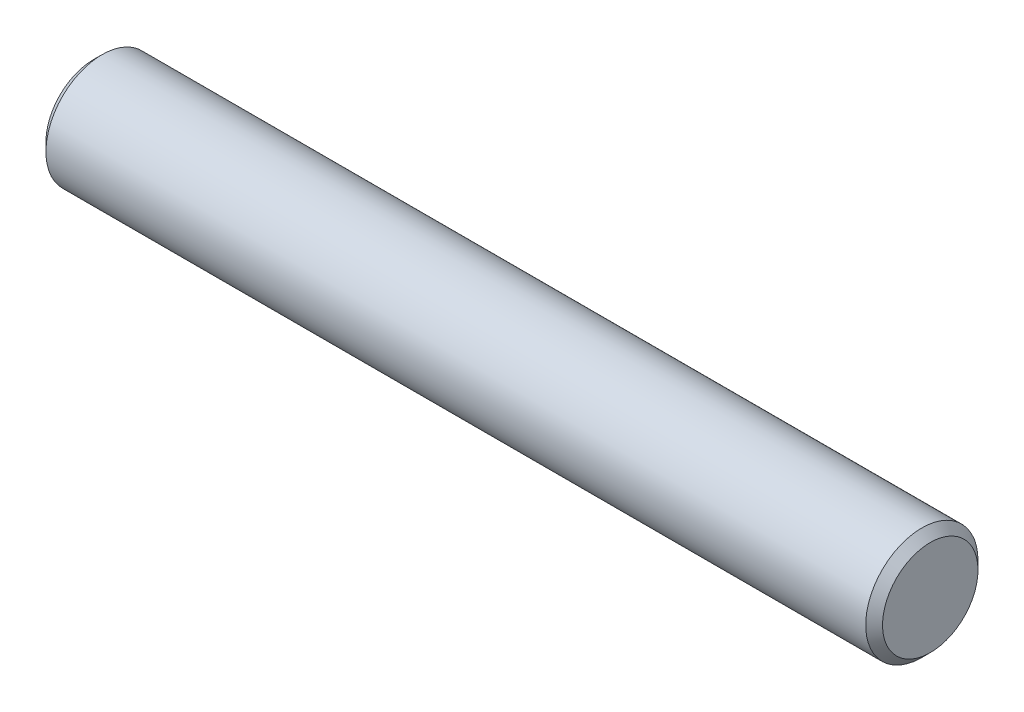
ISO-10303-21;
HEADER;
FILE_DESCRIPTION(('STEP AP214'),'2;1');
FILE_NAME('part.step','',(''),(''),'','','');
FILE_SCHEMA(('AUTOMOTIVE_DESIGN { 1 0 10303 214 1 1 1 1 }'));
ENDSEC;
DATA;
#1=APPLICATION_CONTEXT('core data for automotive mechanical design processes');
#2=APPLICATION_PROTOCOL_DEFINITION('international standard','automotive_design',2000,#1);
#3=PRODUCT_CONTEXT('',#1,'mechanical');
#4=PRODUCT('Part','Part','',(#3));
#5=PRODUCT_RELATED_PRODUCT_CATEGORY('part','',(#4));
#6=PRODUCT_DEFINITION_FORMATION('','',#4);
#7=PRODUCT_DEFINITION_CONTEXT('part definition',#1,'design');
#8=PRODUCT_DEFINITION('design','',#6,#7);
#9=PRODUCT_DEFINITION_SHAPE('','',#8);
#10=(LENGTH_UNIT() NAMED_UNIT(*) SI_UNIT(.MILLI.,.METRE.));
#11=(NAMED_UNIT(*) PLANE_ANGLE_UNIT() SI_UNIT($,.RADIAN.));
#12=(NAMED_UNIT(*) SI_UNIT($,.STERADIAN.) SOLID_ANGLE_UNIT());
#13=UNCERTAINTY_MEASURE_WITH_UNIT(LENGTH_MEASURE(1.E-05),#10,'distance_accuracy_value','');
#14=(GEOMETRIC_REPRESENTATION_CONTEXT(3) GLOBAL_UNCERTAINTY_ASSIGNED_CONTEXT((#13)) GLOBAL_UNIT_ASSIGNED_CONTEXT((#10,
#11,#12)) REPRESENTATION_CONTEXT('',''));
#15=CARTESIAN_POINT('',(0.,0.,0.));
#16=DIRECTION('',(0.,0.,1.));
#17=DIRECTION('',(1.,0.,0.));
#18=AXIS2_PLACEMENT_3D('',#15,#16,#17);
#19=CARTESIAN_POINT('',(7.45,0.,0.));
#20=DIRECTION('',(-1.,0.,0.));
#21=DIRECTION('',(0.,0.,1.));
#22=AXIS2_PLACEMENT_3D('',#19,#20,#21);
#23=CYLINDRICAL_SURFACE('',#22,1.);
#24=CARTESIAN_POINT('',(7.3,0.,0.));
#25=DIRECTION('',(1.,0.,0.));
#26=DIRECTION('',(0.,0.,-1.));
#27=AXIS2_PLACEMENT_3D('',#24,#25,#26);
#28=CIRCLE('',#27,1.);
#29=CARTESIAN_POINT('',(7.3,0.,-1.));
#30=VERTEX_POINT('',#29);
#31=EDGE_CURVE('E45',#30,#30,#28,.F.);
#32=ORIENTED_EDGE('',*,*,#31,.T.);
#33=EDGE_LOOP('',(#32));
#34=FACE_BOUND('',#33,.T.);
#35=CARTESIAN_POINT('',(-7.3,0.,0.));
#36=DIRECTION('',(1.,0.,0.));
#37=DIRECTION('',(0.,0.,-1.));
#38=AXIS2_PLACEMENT_3D('',#35,#36,#37);
#39=CIRCLE('',#38,1.);
#40=CARTESIAN_POINT('',(-7.3,0.,-1.));
#41=VERTEX_POINT('',#40);
#42=EDGE_CURVE('E50',#41,#41,#39,.T.);
#43=ORIENTED_EDGE('',*,*,#42,.T.);
#44=EDGE_LOOP('',(#43));
#45=FACE_BOUND('',#44,.T.);
#46=ADVANCED_FACE('F37',(#34,#45),#23,.T.);
#47=CARTESIAN_POINT('',(7.45,0.,0.));
#48=DIRECTION('',(1.,0.,0.));
#49=DIRECTION('',(0.,0.,-1.));
#50=AXIS2_PLACEMENT_3D('',#47,#48,#49);
#51=PLANE('',#50);
#52=CARTESIAN_POINT('',(7.45,0.,0.));
#53=DIRECTION('',(1.,0.,0.));
#54=DIRECTION('',(0.,0.,-1.));
#55=AXIS2_PLACEMENT_3D('',#52,#53,#54);
#56=CIRCLE('',#55,0.850000000000005);
#57=CARTESIAN_POINT('',(7.45,0.,-0.850000000000005));
#58=VERTEX_POINT('',#57);
#59=EDGE_CURVE('E55',#58,#58,#56,.T.);
#60=ORIENTED_EDGE('',*,*,#59,.T.);
#61=EDGE_LOOP('',(#60));
#62=FACE_BOUND('',#61,.T.);
#63=ADVANCED_FACE('F62',(#62),#51,.T.);
#64=CARTESIAN_POINT('',(-7.45,0.,0.));
#65=DIRECTION('',(1.,0.,0.));
#66=DIRECTION('',(0.,0.,-1.));
#67=AXIS2_PLACEMENT_3D('',#64,#65,#66);
#68=PLANE('',#67);
#69=CARTESIAN_POINT('',(-7.45,0.,0.));
#70=DIRECTION('',(1.,0.,0.));
#71=DIRECTION('',(0.,0.,-1.));
#72=AXIS2_PLACEMENT_3D('',#69,#70,#71);
#73=CIRCLE('',#72,0.85);
#74=CARTESIAN_POINT('',(-7.45,0.,-0.85));
#75=VERTEX_POINT('',#74);
#76=EDGE_CURVE('E10',#75,#75,#73,.F.);
#77=ORIENTED_EDGE('',*,*,#76,.T.);
#78=EDGE_LOOP('',(#77));
#79=FACE_BOUND('',#78,.T.);
#80=ADVANCED_FACE('F66',(#79),#68,.F.);
#81=CARTESIAN_POINT('',(7.45,0.,0.));
#82=DIRECTION('',(-1.,0.,0.));
#83=DIRECTION('',(0.,0.,1.));
#84=AXIS2_PLACEMENT_3D('',#81,#82,#83);
#85=CONICAL_SURFACE('',#84,0.850000000000005,0.785398163397443);
#86=ORIENTED_EDGE('',*,*,#31,.F.);
#87=EDGE_LOOP('',(#86));
#88=FACE_BOUND('',#87,.T.);
#89=ORIENTED_EDGE('',*,*,#59,.F.);
#90=EDGE_LOOP('',(#89));
#91=FACE_BOUND('',#90,.T.);
#92=ADVANCED_FACE('F64',(#88,#91),#85,.T.);
#93=CARTESIAN_POINT('',(-7.3,0.,0.));
#94=DIRECTION('',(1.,0.,0.));
#95=DIRECTION('',(0.,0.,-1.));
#96=AXIS2_PLACEMENT_3D('',#93,#94,#95);
#97=CONICAL_SURFACE('',#96,1.,0.785398163397445);
#98=ORIENTED_EDGE('',*,*,#76,.F.);
#99=EDGE_LOOP('',(#98));
#100=FACE_BOUND('',#99,.T.);
#101=ORIENTED_EDGE('',*,*,#42,.F.);
#102=EDGE_LOOP('',(#101));
#103=FACE_BOUND('',#102,.T.);
#104=ADVANCED_FACE('F39',(#100,#103),#97,.T.);
#105=CLOSED_SHELL('',(#46,#63,#80,#92,#104));
#106=MANIFOLD_SOLID_BREP('B2',#105);
#107=ADVANCED_BREP_SHAPE_REPRESENTATION('',(#18,#106),#14);
#108=SHAPE_DEFINITION_REPRESENTATION(#9,#107);
ENDSEC;
END-ISO-10303-21;
